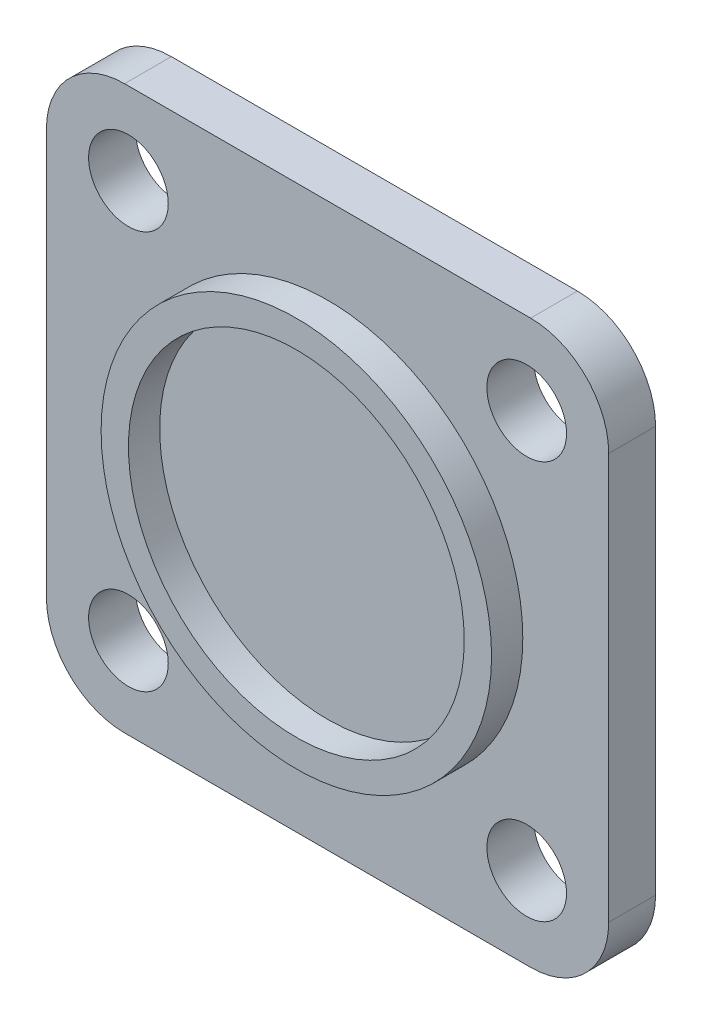
ISO-10303-21;
HEADER;
FILE_DESCRIPTION(('STEP AP214'),'2;1');
FILE_NAME('part.step','',(''),(''),'','','');
FILE_SCHEMA(('AUTOMOTIVE_DESIGN { 1 0 10303 214 1 1 1 1 }'));
ENDSEC;
DATA;
#1=APPLICATION_CONTEXT('core data for automotive mechanical design processes');
#2=APPLICATION_PROTOCOL_DEFINITION('international standard','automotive_design',2000,#1);
#3=PRODUCT_CONTEXT('',#1,'mechanical');
#4=PRODUCT('Part','Part','',(#3));
#5=PRODUCT_RELATED_PRODUCT_CATEGORY('part','',(#4));
#6=PRODUCT_DEFINITION_FORMATION('','',#4);
#7=PRODUCT_DEFINITION_CONTEXT('part definition',#1,'design');
#8=PRODUCT_DEFINITION('design','',#6,#7);
#9=PRODUCT_DEFINITION_SHAPE('','',#8);
#10=(LENGTH_UNIT() NAMED_UNIT(*) SI_UNIT(.MILLI.,.METRE.));
#11=(NAMED_UNIT(*) PLANE_ANGLE_UNIT() SI_UNIT($,.RADIAN.));
#12=(NAMED_UNIT(*) SI_UNIT($,.STERADIAN.) SOLID_ANGLE_UNIT());
#13=UNCERTAINTY_MEASURE_WITH_UNIT(LENGTH_MEASURE(1.E-05),#10,'distance_accuracy_value','');
#14=(GEOMETRIC_REPRESENTATION_CONTEXT(3) GLOBAL_UNCERTAINTY_ASSIGNED_CONTEXT((#13)) GLOBAL_UNIT_ASSIGNED_CONTEXT((#10,
#11,#12)) REPRESENTATION_CONTEXT('',''));
#15=CARTESIAN_POINT('',(0.,0.,0.));
#16=DIRECTION('',(0.,0.,1.));
#17=DIRECTION('',(1.,0.,0.));
#18=AXIS2_PLACEMENT_3D('',#15,#16,#17);
#19=CARTESIAN_POINT('',(-3.0269292409629,-2.81642302497395,3.));
#20=DIRECTION('',(0.,0.,1.));
#21=DIRECTION('',(1.,0.,0.));
#22=AXIS2_PLACEMENT_3D('',#19,#20,#21);
#23=PLANE('',#22);
#24=CARTESIAN_POINT('',(9.9730707590371,-15.816423024974,3.));
#25=DIRECTION('',(0.,0.,1.));
#26=DIRECTION('',(1.,0.,0.));
#27=AXIS2_PLACEMENT_3D('',#24,#25,#26);
#28=CIRCLE('',#27,12.5);
#29=CARTESIAN_POINT('',(22.4730707590371,-15.816423024974,3.));
#30=VERTEX_POINT('',#29);
#31=EDGE_CURVE('E260',#30,#30,#28,.T.);
#32=ORIENTED_EDGE('',*,*,#31,.F.);
#33=EDGE_LOOP('',(#32));
#34=FACE_BOUND('',#33,.T.);
#35=CARTESIAN_POINT('',(-2.77692924096289,-28.566423024974,3.));
#36=DIRECTION('',(0.,0.,1.));
#37=DIRECTION('',(1.,0.,0.));
#38=AXIS2_PLACEMENT_3D('',#35,#36,#37);
#39=CIRCLE('',#38,2.55);
#40=CARTESIAN_POINT('',(-0.226929240962886,-28.566423024974,3.));
#41=VERTEX_POINT('',#40);
#42=EDGE_CURVE('E240',#41,#41,#39,.T.);
#43=ORIENTED_EDGE('',*,*,#42,.F.);
#44=EDGE_LOOP('',(#43));
#45=FACE_BOUND('',#44,.T.);
#46=CARTESIAN_POINT('',(-2.77692924096289,-3.06642302497395,3.));
#47=DIRECTION('',(0.,0.,1.));
#48=DIRECTION('',(1.,0.,0.));
#49=AXIS2_PLACEMENT_3D('',#46,#47,#48);
#50=CIRCLE('',#49,2.55);
#51=CARTESIAN_POINT('',(-0.226929240962886,-3.06642302497395,3.));
#52=VERTEX_POINT('',#51);
#53=EDGE_CURVE('E160',#52,#52,#50,.T.);
#54=ORIENTED_EDGE('',*,*,#53,.F.);
#55=EDGE_LOOP('',(#54));
#56=FACE_BOUND('',#55,.T.);
#57=CARTESIAN_POINT('',(-3.0269292409629,-2.81642302497395,3.));
#58=DIRECTION('',(0.,0.,1.));
#59=DIRECTION('',(1.,0.,0.));
#60=AXIS2_PLACEMENT_3D('',#57,#58,#59);
#61=CIRCLE('',#60,5.);
#62=CARTESIAN_POINT('',(-3.02692924096286,2.18357697502605,3.));
#63=VERTEX_POINT('',#62);
#64=CARTESIAN_POINT('',(-8.0269292409629,-2.81642302497399,3.));
#65=VERTEX_POINT('',#64);
#66=EDGE_CURVE('E178',#63,#65,#61,.T.);
#67=ORIENTED_EDGE('',*,*,#66,.T.);
#68=DIRECTION('',(0.,-1.,0.));
#69=VECTOR('',#68,1.);
#70=CARTESIAN_POINT('',(-8.0269292409629,-2.81642302497399,3.));
#71=LINE('',#70,#69);
#72=CARTESIAN_POINT('',(-8.02692924096289,-28.8164230249739,3.));
#73=VERTEX_POINT('',#72);
#74=EDGE_CURVE('E114',#65,#73,#71,.T.);
#75=ORIENTED_EDGE('',*,*,#74,.T.);
#76=CARTESIAN_POINT('',(-3.02692924096289,-28.816423024974,3.));
#77=DIRECTION('',(0.,0.,1.));
#78=DIRECTION('',(1.,0.,0.));
#79=AXIS2_PLACEMENT_3D('',#76,#77,#78);
#80=CIRCLE('',#79,5.);
#81=CARTESIAN_POINT('',(-3.02692924096286,-33.816423024974,3.));
#82=VERTEX_POINT('',#81);
#83=EDGE_CURVE('E218',#73,#82,#80,.T.);
#84=ORIENTED_EDGE('',*,*,#83,.T.);
#85=DIRECTION('',(1.,0.,0.));
#86=VECTOR('',#85,1.);
#87=CARTESIAN_POINT('',(-3.02692924096286,-33.816423024974,3.));
#88=LINE('',#87,#86);
#89=CARTESIAN_POINT('',(22.9730707590371,-33.816423024974,3.));
#90=VERTEX_POINT('',#89);
#91=EDGE_CURVE('E216',#82,#90,#88,.T.);
#92=ORIENTED_EDGE('',*,*,#91,.T.);
#93=CARTESIAN_POINT('',(22.9730707590371,-28.816423024974,3.));
#94=DIRECTION('',(0.,0.,1.));
#95=DIRECTION('',(1.,0.,0.));
#96=AXIS2_PLACEMENT_3D('',#93,#94,#95);
#97=CIRCLE('',#96,5.);
#98=CARTESIAN_POINT('',(27.9730707590371,-28.8164230249739,3.));
#99=VERTEX_POINT('',#98);
#100=EDGE_CURVE('E133',#90,#99,#97,.T.);
#101=ORIENTED_EDGE('',*,*,#100,.T.);
#102=DIRECTION('',(0.,1.,0.));
#103=VECTOR('',#102,1.);
#104=CARTESIAN_POINT('',(27.9730707590371,-2.81642302497399,3.));
#105=LINE('',#104,#103);
#106=CARTESIAN_POINT('',(27.9730707590371,-2.81642302497399,3.));
#107=VERTEX_POINT('',#106);
#108=EDGE_CURVE('E127',#99,#107,#105,.T.);
#109=ORIENTED_EDGE('',*,*,#108,.T.);
#110=CARTESIAN_POINT('',(22.9730707590371,-2.81642302497395,3.));
#111=DIRECTION('',(0.,0.,1.));
#112=DIRECTION('',(-1.,0.,0.));
#113=AXIS2_PLACEMENT_3D('',#110,#111,#112);
#114=CIRCLE('',#113,5.);
#115=CARTESIAN_POINT('',(22.9730707590371,2.18357697502605,3.));
#116=VERTEX_POINT('',#115);
#117=EDGE_CURVE('E131',#107,#116,#114,.T.);
#118=ORIENTED_EDGE('',*,*,#117,.T.);
#119=DIRECTION('',(-1.,0.,0.));
#120=VECTOR('',#119,1.);
#121=CARTESIAN_POINT('',(-3.02692924096286,2.18357697502605,3.));
#122=LINE('',#121,#120);
#123=EDGE_CURVE('E70',#116,#63,#122,.T.);
#124=ORIENTED_EDGE('',*,*,#123,.T.);
#125=EDGE_LOOP('',(#67,#75,#84,#92,#101,#109,#118,#124));
#126=FACE_BOUND('',#125,.T.);
#127=CARTESIAN_POINT('',(22.7230707590371,-3.06642302497395,3.));
#128=DIRECTION('',(0.,0.,1.));
#129=DIRECTION('',(1.,0.,0.));
#130=AXIS2_PLACEMENT_3D('',#127,#128,#129);
#131=CIRCLE('',#130,2.55);
#132=CARTESIAN_POINT('',(25.2730707590371,-3.06642302497395,3.));
#133=VERTEX_POINT('',#132);
#134=EDGE_CURVE('E232',#133,#133,#131,.T.);
#135=ORIENTED_EDGE('',*,*,#134,.F.);
#136=EDGE_LOOP('',(#135));
#137=FACE_BOUND('',#136,.T.);
#138=CARTESIAN_POINT('',(22.7230707590371,-28.566423024974,3.));
#139=DIRECTION('',(0.,0.,1.));
#140=DIRECTION('',(1.,0.,0.));
#141=AXIS2_PLACEMENT_3D('',#138,#139,#140);
#142=CIRCLE('',#141,2.55);
#143=CARTESIAN_POINT('',(25.2730707590371,-28.566423024974,3.));
#144=VERTEX_POINT('',#143);
#145=EDGE_CURVE('E248',#144,#144,#142,.T.);
#146=ORIENTED_EDGE('',*,*,#145,.F.);
#147=EDGE_LOOP('',(#146));
#148=FACE_BOUND('',#147,.T.);
#149=ADVANCED_FACE('F52',(#34,#45,#56,#126,#137,#148),#23,.T.);
#150=CARTESIAN_POINT('',(-3.0269292409629,-2.81642302497395,0.));
#151=DIRECTION('',(0.,0.,1.));
#152=DIRECTION('',(1.,0.,0.));
#153=AXIS2_PLACEMENT_3D('',#150,#151,#152);
#154=PLANE('',#153);
#155=CARTESIAN_POINT('',(-3.0269292409629,-2.81642302497395,0.));
#156=DIRECTION('',(0.,0.,1.));
#157=DIRECTION('',(1.,0.,0.));
#158=AXIS2_PLACEMENT_3D('',#155,#156,#157);
#159=CIRCLE('',#158,5.);
#160=CARTESIAN_POINT('',(-3.02692924096286,2.18357697502605,0.));
#161=VERTEX_POINT('',#160);
#162=CARTESIAN_POINT('',(-8.0269292409629,-2.81642302497399,0.));
#163=VERTEX_POINT('',#162);
#164=EDGE_CURVE('E155',#161,#163,#159,.T.);
#165=ORIENTED_EDGE('',*,*,#164,.F.);
#166=DIRECTION('',(-1.,0.,0.));
#167=VECTOR('',#166,1.);
#168=CARTESIAN_POINT('',(-3.02692924096286,2.18357697502605,0.));
#169=LINE('',#168,#167);
#170=CARTESIAN_POINT('',(22.9730707590371,2.18357697502605,0.));
#171=VERTEX_POINT('',#170);
#172=EDGE_CURVE('E105',#171,#161,#169,.T.);
#173=ORIENTED_EDGE('',*,*,#172,.F.);
#174=CARTESIAN_POINT('',(22.9730707590371,-2.81642302497395,0.));
#175=DIRECTION('',(0.,0.,1.));
#176=DIRECTION('',(-1.,0.,0.));
#177=AXIS2_PLACEMENT_3D('',#174,#175,#176);
#178=CIRCLE('',#177,5.);
#179=CARTESIAN_POINT('',(27.9730707590371,-2.81642302497399,0.));
#180=VERTEX_POINT('',#179);
#181=EDGE_CURVE('E99',#180,#171,#178,.T.);
#182=ORIENTED_EDGE('',*,*,#181,.F.);
#183=DIRECTION('',(0.,1.,0.));
#184=VECTOR('',#183,1.);
#185=CARTESIAN_POINT('',(27.9730707590371,-2.81642302497399,0.));
#186=LINE('',#185,#184);
#187=CARTESIAN_POINT('',(27.9730707590371,-28.8164230249739,0.));
#188=VERTEX_POINT('',#187);
#189=EDGE_CURVE('E142',#188,#180,#186,.T.);
#190=ORIENTED_EDGE('',*,*,#189,.F.);
#191=CARTESIAN_POINT('',(22.9730707590371,-28.816423024974,0.));
#192=DIRECTION('',(0.,0.,1.));
#193=DIRECTION('',(1.,0.,0.));
#194=AXIS2_PLACEMENT_3D('',#191,#192,#193);
#195=CIRCLE('',#194,5.);
#196=CARTESIAN_POINT('',(22.9730707590371,-33.816423024974,0.));
#197=VERTEX_POINT('',#196);
#198=EDGE_CURVE('E169',#197,#188,#195,.T.);
#199=ORIENTED_EDGE('',*,*,#198,.F.);
#200=DIRECTION('',(1.,0.,0.));
#201=VECTOR('',#200,1.);
#202=CARTESIAN_POINT('',(-3.02692924096286,-33.816423024974,0.));
#203=LINE('',#202,#201);
#204=CARTESIAN_POINT('',(-3.02692924096286,-33.816423024974,0.));
#205=VERTEX_POINT('',#204);
#206=EDGE_CURVE('E166',#205,#197,#203,.T.);
#207=ORIENTED_EDGE('',*,*,#206,.F.);
#208=CARTESIAN_POINT('',(-3.02692924096289,-28.816423024974,0.));
#209=DIRECTION('',(0.,0.,1.));
#210=DIRECTION('',(1.,0.,0.));
#211=AXIS2_PLACEMENT_3D('',#208,#209,#210);
#212=CIRCLE('',#211,5.);
#213=CARTESIAN_POINT('',(-8.02692924096289,-28.8164230249739,0.));
#214=VERTEX_POINT('',#213);
#215=EDGE_CURVE('E163',#214,#205,#212,.T.);
#216=ORIENTED_EDGE('',*,*,#215,.F.);
#217=DIRECTION('',(0.,-1.,0.));
#218=VECTOR('',#217,1.);
#219=CARTESIAN_POINT('',(-8.0269292409629,-2.81642302497399,0.));
#220=LINE('',#219,#218);
#221=EDGE_CURVE('E159',#163,#214,#220,.T.);
#222=ORIENTED_EDGE('',*,*,#221,.F.);
#223=EDGE_LOOP('',(#165,#173,#182,#190,#199,#207,#216,#222));
#224=FACE_BOUND('',#223,.T.);
#225=CARTESIAN_POINT('',(-2.77692924096289,-3.06642302497395,0.));
#226=DIRECTION('',(0.,0.,1.));
#227=DIRECTION('',(1.,0.,0.));
#228=AXIS2_PLACEMENT_3D('',#225,#226,#227);
#229=CIRCLE('',#228,2.55);
#230=CARTESIAN_POINT('',(-0.226929240962886,-3.06642302497395,0.));
#231=VERTEX_POINT('',#230);
#232=EDGE_CURVE('E228',#231,#231,#229,.T.);
#233=ORIENTED_EDGE('',*,*,#232,.T.);
#234=EDGE_LOOP('',(#233));
#235=FACE_BOUND('',#234,.T.);
#236=CARTESIAN_POINT('',(22.7230707590371,-3.06642302497395,0.));
#237=DIRECTION('',(0.,0.,1.));
#238=DIRECTION('',(1.,0.,0.));
#239=AXIS2_PLACEMENT_3D('',#236,#237,#238);
#240=CIRCLE('',#239,2.55);
#241=CARTESIAN_POINT('',(25.2730707590371,-3.06642302497395,0.));
#242=VERTEX_POINT('',#241);
#243=EDGE_CURVE('E236',#242,#242,#240,.T.);
#244=ORIENTED_EDGE('',*,*,#243,.T.);
#245=EDGE_LOOP('',(#244));
#246=FACE_BOUND('',#245,.T.);
#247=CARTESIAN_POINT('',(-2.77692924096289,-28.566423024974,0.));
#248=DIRECTION('',(0.,0.,1.));
#249=DIRECTION('',(1.,0.,0.));
#250=AXIS2_PLACEMENT_3D('',#247,#248,#249);
#251=CIRCLE('',#250,2.55);
#252=CARTESIAN_POINT('',(-0.226929240962886,-28.566423024974,0.));
#253=VERTEX_POINT('',#252);
#254=EDGE_CURVE('E244',#253,#253,#251,.T.);
#255=ORIENTED_EDGE('',*,*,#254,.T.);
#256=EDGE_LOOP('',(#255));
#257=FACE_BOUND('',#256,.T.);
#258=CARTESIAN_POINT('',(22.7230707590371,-28.566423024974,0.));
#259=DIRECTION('',(0.,0.,1.));
#260=DIRECTION('',(1.,0.,0.));
#261=AXIS2_PLACEMENT_3D('',#258,#259,#260);
#262=CIRCLE('',#261,2.55);
#263=CARTESIAN_POINT('',(25.2730707590371,-28.566423024974,0.));
#264=VERTEX_POINT('',#263);
#265=EDGE_CURVE('E252',#264,#264,#262,.T.);
#266=ORIENTED_EDGE('',*,*,#265,.T.);
#267=EDGE_LOOP('',(#266));
#268=FACE_BOUND('',#267,.T.);
#269=ADVANCED_FACE('F203',(#224,#235,#246,#257,#268),#154,.F.);
#270=CARTESIAN_POINT('',(-3.0269292409629,-2.81642302497395,3.));
#271=DIRECTION('',(0.,0.,-1.));
#272=DIRECTION('',(-1.,0.,0.));
#273=AXIS2_PLACEMENT_3D('',#270,#271,#272);
#274=CYLINDRICAL_SURFACE('',#273,5.);
#275=ORIENTED_EDGE('',*,*,#164,.T.);
#276=DIRECTION('',(0.,0.,-1.));
#277=VECTOR('',#276,1.);
#278=CARTESIAN_POINT('',(-8.0269292409629,-2.81642302497399,3.));
#279=LINE('',#278,#277);
#280=EDGE_CURVE('E62',#65,#163,#279,.T.);
#281=ORIENTED_EDGE('',*,*,#280,.F.);
#282=ORIENTED_EDGE('',*,*,#66,.F.);
#283=DIRECTION('',(0.,0.,-1.));
#284=VECTOR('',#283,1.);
#285=CARTESIAN_POINT('',(-3.02692924096286,2.18357697502605,3.));
#286=LINE('',#285,#284);
#287=EDGE_CURVE('E151',#63,#161,#286,.T.);
#288=ORIENTED_EDGE('',*,*,#287,.T.);
#289=EDGE_LOOP('',(#275,#281,#282,#288));
#290=FACE_BOUND('',#289,.T.);
#291=ADVANCED_FACE('F54',(#290),#274,.T.);
#292=CARTESIAN_POINT('',(-8.0269292409629,-2.81642302497399,3.));
#293=DIRECTION('',(1.,0.,0.));
#294=DIRECTION('',(0.,1.,0.));
#295=AXIS2_PLACEMENT_3D('',#292,#293,#294);
#296=PLANE('',#295);
#297=ORIENTED_EDGE('',*,*,#221,.T.);
#298=DIRECTION('',(0.,0.,-1.));
#299=VECTOR('',#298,1.);
#300=CARTESIAN_POINT('',(-8.02692924096289,-28.8164230249739,3.));
#301=LINE('',#300,#299);
#302=EDGE_CURVE('E193',#73,#214,#301,.T.);
#303=ORIENTED_EDGE('',*,*,#302,.F.);
#304=ORIENTED_EDGE('',*,*,#74,.F.);
#305=ORIENTED_EDGE('',*,*,#280,.T.);
#306=EDGE_LOOP('',(#297,#303,#304,#305));
#307=FACE_BOUND('',#306,.T.);
#308=ADVANCED_FACE('F198',(#307),#296,.F.);
#309=CARTESIAN_POINT('',(-3.02692924096289,-28.816423024974,3.));
#310=DIRECTION('',(0.,0.,-1.));
#311=DIRECTION('',(-1.,0.,0.));
#312=AXIS2_PLACEMENT_3D('',#309,#310,#311);
#313=CYLINDRICAL_SURFACE('',#312,5.);
#314=ORIENTED_EDGE('',*,*,#215,.T.);
#315=DIRECTION('',(0.,0.,-1.));
#316=VECTOR('',#315,1.);
#317=CARTESIAN_POINT('',(-3.02692924096286,-33.816423024974,3.));
#318=LINE('',#317,#316);
#319=EDGE_CURVE('E189',#82,#205,#318,.T.);
#320=ORIENTED_EDGE('',*,*,#319,.F.);
#321=ORIENTED_EDGE('',*,*,#83,.F.);
#322=ORIENTED_EDGE('',*,*,#302,.T.);
#323=EDGE_LOOP('',(#314,#320,#321,#322));
#324=FACE_BOUND('',#323,.T.);
#325=ADVANCED_FACE('F210',(#324),#313,.T.);
#326=CARTESIAN_POINT('',(-3.02692924096286,-33.816423024974,3.));
#327=DIRECTION('',(0.,1.,0.));
#328=DIRECTION('',(0.,0.,1.));
#329=AXIS2_PLACEMENT_3D('',#326,#327,#328);
#330=PLANE('',#329);
#331=ORIENTED_EDGE('',*,*,#206,.T.);
#332=DIRECTION('',(0.,0.,-1.));
#333=VECTOR('',#332,1.);
#334=CARTESIAN_POINT('',(22.9730707590371,-33.816423024974,3.));
#335=LINE('',#334,#333);
#336=EDGE_CURVE('E185',#90,#197,#335,.T.);
#337=ORIENTED_EDGE('',*,*,#336,.F.);
#338=ORIENTED_EDGE('',*,*,#91,.F.);
#339=ORIENTED_EDGE('',*,*,#319,.T.);
#340=EDGE_LOOP('',(#331,#337,#338,#339));
#341=FACE_BOUND('',#340,.T.);
#342=ADVANCED_FACE('F214',(#341),#330,.F.);
#343=CARTESIAN_POINT('',(22.9730707590371,-28.816423024974,3.));
#344=DIRECTION('',(0.,0.,-1.));
#345=DIRECTION('',(-1.,0.,0.));
#346=AXIS2_PLACEMENT_3D('',#343,#344,#345);
#347=CYLINDRICAL_SURFACE('',#346,5.);
#348=ORIENTED_EDGE('',*,*,#198,.T.);
#349=DIRECTION('',(0.,0.,-1.));
#350=VECTOR('',#349,1.);
#351=CARTESIAN_POINT('',(27.9730707590371,-28.8164230249739,3.));
#352=LINE('',#351,#350);
#353=EDGE_CURVE('E144',#99,#188,#352,.T.);
#354=ORIENTED_EDGE('',*,*,#353,.F.);
#355=ORIENTED_EDGE('',*,*,#100,.F.);
#356=ORIENTED_EDGE('',*,*,#336,.T.);
#357=EDGE_LOOP('',(#348,#354,#355,#356));
#358=FACE_BOUND('',#357,.T.);
#359=ADVANCED_FACE('F393',(#358),#347,.T.);
#360=CARTESIAN_POINT('',(27.9730707590371,-2.81642302497399,3.));
#361=DIRECTION('',(-1.,0.,0.));
#362=DIRECTION('',(0.,-1.,0.));
#363=AXIS2_PLACEMENT_3D('',#360,#361,#362);
#364=PLANE('',#363);
#365=ORIENTED_EDGE('',*,*,#189,.T.);
#366=DIRECTION('',(0.,0.,-1.));
#367=VECTOR('',#366,1.);
#368=CARTESIAN_POINT('',(27.9730707590371,-2.81642302497399,3.));
#369=LINE('',#368,#367);
#370=EDGE_CURVE('E139',#107,#180,#369,.T.);
#371=ORIENTED_EDGE('',*,*,#370,.F.);
#372=ORIENTED_EDGE('',*,*,#108,.F.);
#373=ORIENTED_EDGE('',*,*,#353,.T.);
#374=EDGE_LOOP('',(#365,#371,#372,#373));
#375=FACE_BOUND('',#374,.T.);
#376=ADVANCED_FACE('F140',(#375),#364,.F.);
#377=CARTESIAN_POINT('',(22.9730707590371,-2.81642302497395,3.));
#378=DIRECTION('',(0.,0.,-1.));
#379=DIRECTION('',(-1.,0.,0.));
#380=AXIS2_PLACEMENT_3D('',#377,#378,#379);
#381=CYLINDRICAL_SURFACE('',#380,5.);
#382=ORIENTED_EDGE('',*,*,#181,.T.);
#383=DIRECTION('',(0.,0.,-1.));
#384=VECTOR('',#383,1.);
#385=CARTESIAN_POINT('',(22.9730707590371,2.18357697502605,3.));
#386=LINE('',#385,#384);
#387=EDGE_CURVE('E145',#116,#171,#386,.T.);
#388=ORIENTED_EDGE('',*,*,#387,.F.);
#389=ORIENTED_EDGE('',*,*,#117,.F.);
#390=ORIENTED_EDGE('',*,*,#370,.T.);
#391=EDGE_LOOP('',(#382,#388,#389,#390));
#392=FACE_BOUND('',#391,.T.);
#393=ADVANCED_FACE('F147',(#392),#381,.T.);
#394=CARTESIAN_POINT('',(-3.02692924096286,2.18357697502605,3.));
#395=DIRECTION('',(0.,-1.,0.));
#396=DIRECTION('',(0.,0.,-1.));
#397=AXIS2_PLACEMENT_3D('',#394,#395,#396);
#398=PLANE('',#397);
#399=ORIENTED_EDGE('',*,*,#172,.T.);
#400=ORIENTED_EDGE('',*,*,#287,.F.);
#401=ORIENTED_EDGE('',*,*,#123,.F.);
#402=ORIENTED_EDGE('',*,*,#387,.T.);
#403=EDGE_LOOP('',(#399,#400,#401,#402));
#404=FACE_BOUND('',#403,.T.);
#405=ADVANCED_FACE('F365',(#404),#398,.F.);
#406=CARTESIAN_POINT('',(-2.77692924096289,-3.06642302497395,3.));
#407=DIRECTION('',(0.,0.,-1.));
#408=DIRECTION('',(-1.,0.,0.));
#409=AXIS2_PLACEMENT_3D('',#406,#407,#408);
#410=CYLINDRICAL_SURFACE('',#409,2.55);
#411=ORIENTED_EDGE('',*,*,#53,.T.);
#412=EDGE_LOOP('',(#411));
#413=FACE_BOUND('',#412,.T.);
#414=ORIENTED_EDGE('',*,*,#232,.F.);
#415=EDGE_LOOP('',(#414));
#416=FACE_BOUND('',#415,.T.);
#417=ADVANCED_FACE('F354',(#413,#416),#410,.F.);
#418=CARTESIAN_POINT('',(22.7230707590371,-3.06642302497395,3.));
#419=DIRECTION('',(0.,0.,-1.));
#420=DIRECTION('',(-1.,0.,0.));
#421=AXIS2_PLACEMENT_3D('',#418,#419,#420);
#422=CYLINDRICAL_SURFACE('',#421,2.55);
#423=ORIENTED_EDGE('',*,*,#134,.T.);
#424=EDGE_LOOP('',(#423));
#425=FACE_BOUND('',#424,.T.);
#426=ORIENTED_EDGE('',*,*,#243,.F.);
#427=EDGE_LOOP('',(#426));
#428=FACE_BOUND('',#427,.T.);
#429=ADVANCED_FACE('F343',(#425,#428),#422,.F.);
#430=CARTESIAN_POINT('',(-2.77692924096289,-28.566423024974,3.));
#431=DIRECTION('',(0.,0.,-1.));
#432=DIRECTION('',(-1.,0.,0.));
#433=AXIS2_PLACEMENT_3D('',#430,#431,#432);
#434=CYLINDRICAL_SURFACE('',#433,2.55);
#435=ORIENTED_EDGE('',*,*,#42,.T.);
#436=EDGE_LOOP('',(#435));
#437=FACE_BOUND('',#436,.T.);
#438=ORIENTED_EDGE('',*,*,#254,.F.);
#439=EDGE_LOOP('',(#438));
#440=FACE_BOUND('',#439,.T.);
#441=ADVANCED_FACE('F287',(#437,#440),#434,.F.);
#442=CARTESIAN_POINT('',(22.7230707590371,-28.566423024974,3.));
#443=DIRECTION('',(0.,0.,-1.));
#444=DIRECTION('',(-1.,0.,0.));
#445=AXIS2_PLACEMENT_3D('',#442,#443,#444);
#446=CYLINDRICAL_SURFACE('',#445,2.55);
#447=ORIENTED_EDGE('',*,*,#145,.T.);
#448=EDGE_LOOP('',(#447));
#449=FACE_BOUND('',#448,.T.);
#450=ORIENTED_EDGE('',*,*,#265,.F.);
#451=EDGE_LOOP('',(#450));
#452=FACE_BOUND('',#451,.T.);
#453=ADVANCED_FACE('F278',(#449,#452),#446,.F.);
#454=CARTESIAN_POINT('',(9.9730707590371,-15.816423024974,5.));
#455=DIRECTION('',(0.,0.,1.));
#456=DIRECTION('',(1.,0.,0.));
#457=AXIS2_PLACEMENT_3D('',#454,#455,#456);
#458=PLANE('',#457);
#459=CARTESIAN_POINT('',(9.9730707590371,-15.816423024974,5.));
#460=DIRECTION('',(0.,0.,1.));
#461=DIRECTION('',(1.,0.,0.));
#462=AXIS2_PLACEMENT_3D('',#459,#460,#461);
#463=CIRCLE('',#462,12.5);
#464=CARTESIAN_POINT('',(22.4730707590371,-15.816423024974,5.));
#465=VERTEX_POINT('',#464);
#466=EDGE_CURVE('E256',#465,#465,#463,.T.);
#467=ORIENTED_EDGE('',*,*,#466,.T.);
#468=EDGE_LOOP('',(#467));
#469=FACE_BOUND('',#468,.T.);
#470=CARTESIAN_POINT('',(9.9730707590371,-15.816423024974,5.));
#471=DIRECTION('',(0.,0.,1.));
#472=DIRECTION('',(1.,0.,0.));
#473=AXIS2_PLACEMENT_3D('',#470,#471,#472);
#474=CIRCLE('',#473,10.75);
#475=CARTESIAN_POINT('',(20.7230707590371,-15.816423024974,5.));
#476=VERTEX_POINT('',#475);
#477=EDGE_CURVE('E264',#476,#476,#474,.T.);
#478=ORIENTED_EDGE('',*,*,#477,.F.);
#479=EDGE_LOOP('',(#478));
#480=FACE_BOUND('',#479,.T.);
#481=ADVANCED_FACE('F275',(#469,#480),#458,.T.);
#482=CARTESIAN_POINT('',(9.9730707590371,-15.816423024974,5.));
#483=DIRECTION('',(0.,0.,-1.));
#484=DIRECTION('',(-1.,0.,0.));
#485=AXIS2_PLACEMENT_3D('',#482,#483,#484);
#486=CYLINDRICAL_SURFACE('',#485,12.5);
#487=ORIENTED_EDGE('',*,*,#466,.F.);
#488=EDGE_LOOP('',(#487));
#489=FACE_BOUND('',#488,.T.);
#490=ORIENTED_EDGE('',*,*,#31,.T.);
#491=EDGE_LOOP('',(#490));
#492=FACE_BOUND('',#491,.T.);
#493=ADVANCED_FACE('F277',(#489,#492),#486,.T.);
#494=CARTESIAN_POINT('',(9.9730707590371,-15.816423024974,5.));
#495=DIRECTION('',(0.,0.,-1.));
#496=DIRECTION('',(-1.,0.,0.));
#497=AXIS2_PLACEMENT_3D('',#494,#495,#496);
#498=CYLINDRICAL_SURFACE('',#497,10.75);
#499=ORIENTED_EDGE('',*,*,#477,.T.);
#500=EDGE_LOOP('',(#499));
#501=FACE_BOUND('',#500,.T.);
#502=CARTESIAN_POINT('',(9.9730707590371,-15.816423024974,3.));
#503=DIRECTION('',(0.,0.,1.));
#504=DIRECTION('',(1.,0.,0.));
#505=AXIS2_PLACEMENT_3D('',#502,#503,#504);
#506=CIRCLE('',#505,10.75);
#507=CARTESIAN_POINT('',(20.7230707590371,-15.816423024974,3.));
#508=VERTEX_POINT('',#507);
#509=EDGE_CURVE('E12',#508,#508,#506,.F.);
#510=ORIENTED_EDGE('',*,*,#509,.T.);
#511=EDGE_LOOP('',(#510));
#512=FACE_BOUND('',#511,.T.);
#513=ADVANCED_FACE('F272',(#501,#512),#498,.F.);
#514=ORIENTED_EDGE('',*,*,#509,.F.);
#515=EDGE_LOOP('',(#514));
#516=FACE_BOUND('',#515,.T.);
#517=ADVANCED_FACE('F294',(#516),#23,.T.);
#518=CLOSED_SHELL('',(#149,#269,#291,#308,#325,#342,#359,#376,#393,#405,#417,#429,#441,#453,
#481,#493,#513,#517));
#519=MANIFOLD_SOLID_BREP('B2',#518);
#520=ADVANCED_BREP_SHAPE_REPRESENTATION('',(#18,#519),#14);
#521=SHAPE_DEFINITION_REPRESENTATION(#9,#520);
ENDSEC;
END-ISO-10303-21;
